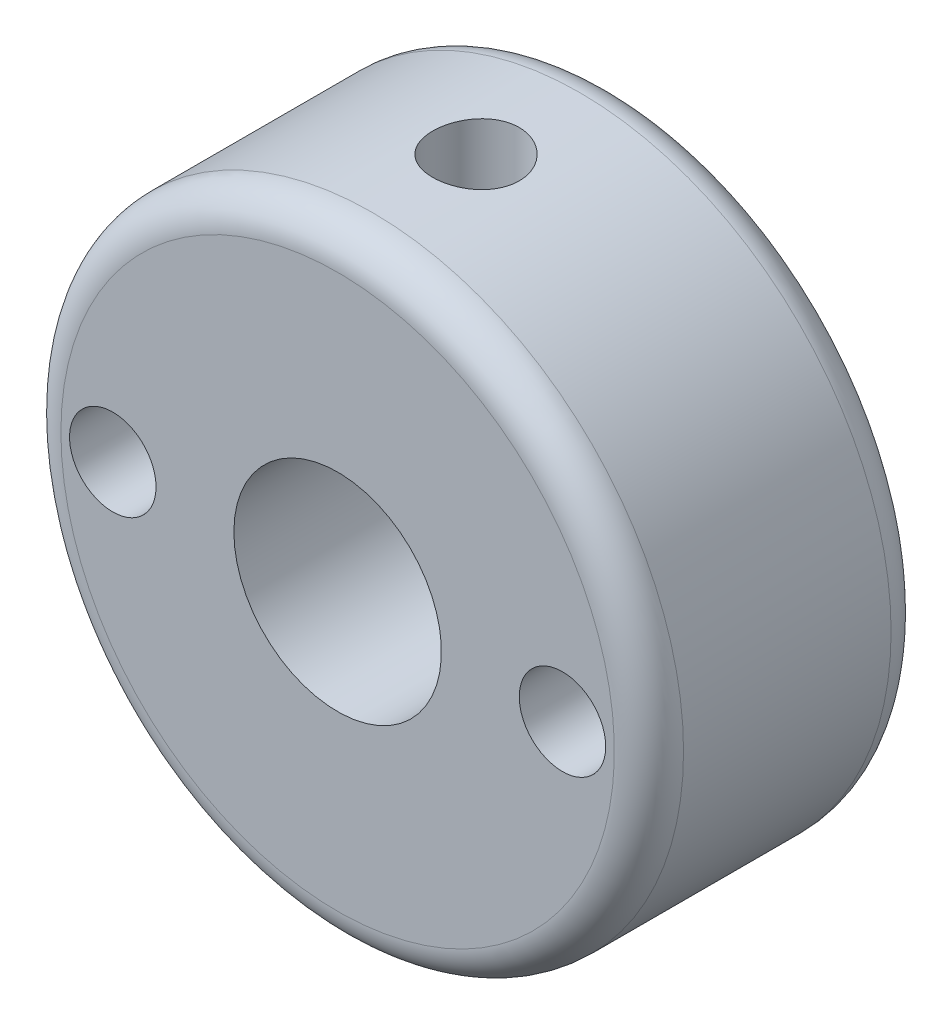
ISO-10303-21;
HEADER;
FILE_DESCRIPTION(('STEP AP214'),'2;1');
FILE_NAME('part.step','',(''),(''),'','','');
FILE_SCHEMA(('AUTOMOTIVE_DESIGN { 1 0 10303 214 1 1 1 1 }'));
ENDSEC;
DATA;
#1=APPLICATION_CONTEXT('core data for automotive mechanical design processes');
#2=APPLICATION_PROTOCOL_DEFINITION('international standard','automotive_design',2000,#1);
#3=PRODUCT_CONTEXT('',#1,'mechanical');
#4=PRODUCT('Part','Part','',(#3));
#5=PRODUCT_RELATED_PRODUCT_CATEGORY('part','',(#4));
#6=PRODUCT_DEFINITION_FORMATION('','',#4);
#7=PRODUCT_DEFINITION_CONTEXT('part definition',#1,'design');
#8=PRODUCT_DEFINITION('design','',#6,#7);
#9=PRODUCT_DEFINITION_SHAPE('','',#8);
#10=(LENGTH_UNIT() NAMED_UNIT(*) SI_UNIT(.MILLI.,.METRE.));
#11=(NAMED_UNIT(*) PLANE_ANGLE_UNIT() SI_UNIT($,.RADIAN.));
#12=(NAMED_UNIT(*) SI_UNIT($,.STERADIAN.) SOLID_ANGLE_UNIT());
#13=UNCERTAINTY_MEASURE_WITH_UNIT(LENGTH_MEASURE(1.E-05),#10,'distance_accuracy_value','');
#14=(GEOMETRIC_REPRESENTATION_CONTEXT(3) GLOBAL_UNCERTAINTY_ASSIGNED_CONTEXT((#13)) GLOBAL_UNIT_ASSIGNED_CONTEXT((#10,
#11,#12)) REPRESENTATION_CONTEXT('',''));
#15=CARTESIAN_POINT('',(0.,0.,0.));
#16=DIRECTION('',(0.,0.,1.));
#17=DIRECTION('',(1.,0.,0.));
#18=AXIS2_PLACEMENT_3D('',#15,#16,#17);
#19=CARTESIAN_POINT('',(0.,0.,8.));
#20=DIRECTION('',(0.,0.,-1.));
#21=DIRECTION('',(-1.,0.,0.));
#22=AXIS2_PLACEMENT_3D('',#19,#20,#21);
#23=PLANE('',#22);
#24=CARTESIAN_POINT('',(0.,0.,8.));
#25=DIRECTION('',(0.,0.,-1.));
#26=DIRECTION('',(-1.,0.,0.));
#27=AXIS2_PLACEMENT_3D('',#24,#25,#26);
#28=CIRCLE('',#27,8.);
#29=CARTESIAN_POINT('',(-8.,0.,8.));
#30=VERTEX_POINT('',#29);
#31=EDGE_CURVE('E10',#30,#30,#28,.F.);
#32=ORIENTED_EDGE('',*,*,#31,.T.);
#33=EDGE_LOOP('',(#32));
#34=FACE_BOUND('',#33,.T.);
#35=CARTESIAN_POINT('',(0.,0.,8.));
#36=DIRECTION('',(0.,0.,-1.));
#37=DIRECTION('',(-1.,0.,0.));
#38=AXIS2_PLACEMENT_3D('',#35,#36,#37);
#39=CIRCLE('',#38,3.);
#40=CARTESIAN_POINT('',(-3.,0.,8.));
#41=VERTEX_POINT('',#40);
#42=EDGE_CURVE('E109',#41,#41,#39,.T.);
#43=ORIENTED_EDGE('',*,*,#42,.T.);
#44=EDGE_LOOP('',(#43));
#45=FACE_BOUND('',#44,.T.);
#46=CARTESIAN_POINT('',(6.5,0.,8.));
#47=DIRECTION('',(0.,0.,1.));
#48=DIRECTION('',(1.,0.,0.));
#49=AXIS2_PLACEMENT_3D('',#46,#47,#48);
#50=CIRCLE('',#49,1.24999999999999);
#51=CARTESIAN_POINT('',(7.74999999999999,0.,8.));
#52=VERTEX_POINT('',#51);
#53=EDGE_CURVE('E112',#52,#52,#50,.T.);
#54=ORIENTED_EDGE('',*,*,#53,.F.);
#55=EDGE_LOOP('',(#54));
#56=FACE_BOUND('',#55,.T.);
#57=CARTESIAN_POINT('',(-6.5,0.,8.));
#58=DIRECTION('',(0.,0.,1.));
#59=DIRECTION('',(1.,0.,0.));
#60=AXIS2_PLACEMENT_3D('',#57,#58,#59);
#61=CIRCLE('',#60,1.24999999999999);
#62=CARTESIAN_POINT('',(-5.25000000000001,0.,8.));
#63=VERTEX_POINT('',#62);
#64=EDGE_CURVE('E117',#63,#63,#61,.T.);
#65=ORIENTED_EDGE('',*,*,#64,.F.);
#66=EDGE_LOOP('',(#65));
#67=FACE_BOUND('',#66,.T.);
#68=ADVANCED_FACE('F35',(#34,#45,#56,#67),#23,.F.);
#69=CARTESIAN_POINT('',(0.,0.,0.));
#70=DIRECTION('',(0.,0.,-1.));
#71=DIRECTION('',(-1.,0.,0.));
#72=AXIS2_PLACEMENT_3D('',#69,#70,#71);
#73=PLANE('',#72);
#74=CARTESIAN_POINT('',(0.,0.,0.));
#75=DIRECTION('',(0.,0.,-1.));
#76=DIRECTION('',(-1.,0.,0.));
#77=AXIS2_PLACEMENT_3D('',#74,#75,#76);
#78=CIRCLE('',#77,8.);
#79=CARTESIAN_POINT('',(-8.,0.,0.));
#80=VERTEX_POINT('',#79);
#81=EDGE_CURVE('E50',#80,#80,#78,.T.);
#82=ORIENTED_EDGE('',*,*,#81,.T.);
#83=EDGE_LOOP('',(#82));
#84=FACE_BOUND('',#83,.T.);
#85=CARTESIAN_POINT('',(0.,0.,0.));
#86=DIRECTION('',(0.,0.,-1.));
#87=DIRECTION('',(-1.,0.,0.));
#88=AXIS2_PLACEMENT_3D('',#85,#86,#87);
#89=CIRCLE('',#88,3.);
#90=CARTESIAN_POINT('',(-3.,0.,0.));
#91=VERTEX_POINT('',#90);
#92=EDGE_CURVE('E106',#91,#91,#89,.T.);
#93=ORIENTED_EDGE('',*,*,#92,.F.);
#94=EDGE_LOOP('',(#93));
#95=FACE_BOUND('',#94,.T.);
#96=CARTESIAN_POINT('',(6.5,0.,0.));
#97=DIRECTION('',(0.,0.,1.));
#98=DIRECTION('',(1.,0.,0.));
#99=AXIS2_PLACEMENT_3D('',#96,#97,#98);
#100=CIRCLE('',#99,1.25);
#101=CARTESIAN_POINT('',(7.75,0.,0.));
#102=VERTEX_POINT('',#101);
#103=EDGE_CURVE('E115',#102,#102,#100,.T.);
#104=ORIENTED_EDGE('',*,*,#103,.T.);
#105=EDGE_LOOP('',(#104));
#106=FACE_BOUND('',#105,.T.);
#107=CARTESIAN_POINT('',(-6.5,0.,0.));
#108=DIRECTION('',(0.,0.,1.));
#109=DIRECTION('',(1.,0.,0.));
#110=AXIS2_PLACEMENT_3D('',#107,#108,#109);
#111=CIRCLE('',#110,1.25);
#112=CARTESIAN_POINT('',(-5.25,0.,0.));
#113=VERTEX_POINT('',#112);
#114=EDGE_CURVE('E63',#113,#113,#111,.T.);
#115=ORIENTED_EDGE('',*,*,#114,.T.);
#116=EDGE_LOOP('',(#115));
#117=FACE_BOUND('',#116,.T.);
#118=ADVANCED_FACE('F83',(#84,#95,#106,#117),#73,.T.);
#119=CARTESIAN_POINT('',(0.,9.,4.));
#120=DIRECTION('',(0.,1.,0.));
#121=DIRECTION('',(0.,0.,1.));
#122=AXIS2_PLACEMENT_3D('',#119,#120,#121);
#123=CYLINDRICAL_SURFACE('',#122,1.25);
#124=CARTESIAN_POINT('',(0.,3.,5.25));
#125=CARTESIAN_POINT('',(0.0669580526362668,2.99999458367272,5.2499927949087));
#126=CARTESIAN_POINT('',(0.134021397063841,2.9977323297471,5.24458804147186));
#127=CARTESIAN_POINT('',(0.266247371156347,2.98890153579551,5.22316093507982));
#128=CARTESIAN_POINT('',(0.331404576423564,2.98232175901028,5.20711087553575));
#129=CARTESIAN_POINT('',(0.457688733653087,2.96556289038127,5.16508890821941));
#130=CARTESIAN_POINT('',(0.518828524426268,2.95539599975003,5.13915061053185));
#131=CARTESIAN_POINT('',(0.635829756679802,2.93245286470664,5.07822717676743));
#132=CARTESIAN_POINT('',(0.691692790015939,2.91967741092849,5.04324478102913));
#133=CARTESIAN_POINT('',(0.799448403559511,2.89207828351869,4.96337101740912));
#134=CARTESIAN_POINT('',(0.851041267517768,2.87718753326093,4.91809869121025));
#135=CARTESIAN_POINT('',(0.946159821091261,2.84732714068513,4.81973566521743));
#136=CARTESIAN_POINT('',(0.989681263153085,2.83235746106809,4.76664087510549));
#137=CARTESIAN_POINT('',(1.06953737697065,2.80321021812995,4.65097322243511));
#138=CARTESIAN_POINT('',(1.10541308153925,2.78910786873385,4.58806255157346));
#139=CARTESIAN_POINT('',(1.16593940588866,2.76435572357005,4.45642674207907));
#140=CARTESIAN_POINT('',(1.19059580836291,2.75370415000823,4.38770462051555));
#141=CARTESIAN_POINT('',(1.22674598312159,2.73778555387705,4.24984630823208));
#142=CARTESIAN_POINT('',(1.23881657877606,2.73228387651787,4.18088951660785));
#143=CARTESIAN_POINT('',(1.25125209967796,2.72661326219504,4.04172670731343));
#144=CARTESIAN_POINT('',(1.25162348054397,2.7264413842526,3.97152139997426));
#145=CARTESIAN_POINT('',(1.24108450363674,2.73125119560852,3.83759993956506));
#146=CARTESIAN_POINT('',(1.23103681112301,2.73583882723623,3.77379890343554));
#147=CARTESIAN_POINT('',(1.20139191015777,2.74898482773796,3.64888790899961));
#148=CARTESIAN_POINT('',(1.18179287287177,2.75754395703563,3.58777846850823));
#149=CARTESIAN_POINT('',(1.13321958727571,2.77786184772756,3.46844229700856));
#150=CARTESIAN_POINT('',(1.10405471539236,2.78968481949136,3.41030457908662));
#151=CARTESIAN_POINT('',(1.03731242580562,2.81518331141086,3.29952226611985));
#152=CARTESIAN_POINT('',(0.999731690519544,2.82885956129779,3.24687984938648));
#153=CARTESIAN_POINT('',(0.913495965543835,2.85792976877979,3.14390004126716));
#154=CARTESIAN_POINT('',(0.864173483207526,2.87337121404473,3.09413343261456));
#155=CARTESIAN_POINT('',(0.757729591051512,2.90325673112529,3.00338649704082));
#156=CARTESIAN_POINT('',(0.700606359448456,2.9177005687701,2.96240822830782));
#157=CARTESIAN_POINT('',(0.578447948693376,2.94438283556473,2.88956417638373));
#158=CARTESIAN_POINT('',(0.51326058244768,2.95656266543333,2.85793055484932));
#159=CARTESIAN_POINT('',(0.377852402526832,2.97689481414803,2.80627886039674));
#160=CARTESIAN_POINT('',(0.307634394795035,2.985049358458,2.78625436805618));
#161=CARTESIAN_POINT('',(0.168928113346228,2.99599641186385,2.75958400787336));
#162=CARTESIAN_POINT('',(0.100611285278639,2.99909541047125,2.75217214255625));
#163=CARTESIAN_POINT('',(-0.0363546554960886,3.00056050368745,2.74865377638591));
#164=CARTESIAN_POINT('',(-0.105003667152635,2.99892795711939,2.752544029748));
#165=CARTESIAN_POINT('',(-0.237098242341435,2.9913121765694,2.77097108480607));
#166=CARTESIAN_POINT('',(-0.300632966639386,2.98554887283989,2.7849699540972));
#167=CARTESIAN_POINT('',(-0.42438274897109,2.97048606772414,2.82246819454078));
#168=CARTESIAN_POINT('',(-0.48459738651836,2.96118611959704,2.8459687659503));
#169=CARTESIAN_POINT('',(-0.602108999869136,2.93958270645166,2.90257097571212));
#170=CARTESIAN_POINT('',(-0.659257236855324,2.92719491469281,2.93594818314603));
#171=CARTESIAN_POINT('',(-0.767346216231429,2.9007380457909,3.0110533777917));
#172=CARTESIAN_POINT('',(-0.81828435260194,2.88666826768733,3.05278485152928));
#173=CARTESIAN_POINT('',(-0.916333430274263,2.85712087895437,3.14690323327241));
#174=CARTESIAN_POINT('',(-0.962910697979835,2.84161451591029,3.19983850298626));
#175=CARTESIAN_POINT('',(-1.04666984610551,2.81184336768005,3.31302127593539));
#176=CARTESIAN_POINT('',(-1.08384959285617,2.79757886493438,3.37327043517173));
#177=CARTESIAN_POINT('',(-1.14815960208699,2.77181386243988,3.50061417530258));
#178=CARTESIAN_POINT('',(-1.17513918237329,2.76035562555111,3.56779403551483));
#179=CARTESIAN_POINT('',(-1.21717413951573,2.74208355658957,3.70637059381011));
#180=CARTESIAN_POINT('',(-1.23223934863687,2.73526589555752,3.77776376248335));
#181=CARTESIAN_POINT('',(-1.24904080348901,2.72763164537264,3.91681869919921));
#182=CARTESIAN_POINT('',(-1.25171380413129,2.72639350967162,3.98434466229262));
#183=CARTESIAN_POINT('',(-1.24615575523912,2.72893853011024,4.1188428611411));
#184=CARTESIAN_POINT('',(-1.23792637964721,2.73272091540306,4.18581518031369));
#185=CARTESIAN_POINT('',(-1.21158404780491,2.74449551302268,4.31409274746889));
#186=CARTESIAN_POINT('',(-1.19394903571466,2.7522835484648,4.37551667346339));
#187=CARTESIAN_POINT('',(-1.14976328202134,2.77103181199189,4.49454802135723));
#188=CARTESIAN_POINT('',(-1.12321003517252,2.78199293131693,4.55215436539878));
#189=CARTESIAN_POINT('',(-1.06010285935489,2.80666954560013,4.66569589594912));
#190=CARTESIAN_POINT('',(-1.02304360910483,2.82051102713679,4.72132233016829));
#191=CARTESIAN_POINT('',(-0.940684072630391,2.84903689053839,4.82586013936068));
#192=CARTESIAN_POINT('',(-0.895380928905618,2.86372156345875,4.87476917560057));
#193=CARTESIAN_POINT('',(-0.79390204577882,2.89356392850106,4.96814868168474));
#194=CARTESIAN_POINT('',(-0.737174739949026,2.90867817511791,5.01203643284065));
#195=CARTESIAN_POINT('',(-0.616600079253198,2.9366014362202,5.08969945354363));
#196=CARTESIAN_POINT('',(-0.552749497945745,2.9494093991674,5.12347011488955));
#197=CARTESIAN_POINT('',(-0.42073205671795,2.9710918336246,5.17920984543988));
#198=CARTESIAN_POINT('',(-0.352653990980635,2.98002782581964,5.2013647666173));
#199=CARTESIAN_POINT('',(-0.213410421846558,2.99321009768625,5.23370632907783));
#200=CARTESIAN_POINT('',(-0.142255316980957,2.99747105811967,5.24393044252988));
#201=CARTESIAN_POINT('',(-0.0472360819191829,2.99972287568934,5.24933316108645));
#202=CARTESIAN_POINT('',(-0.0236245946756569,3.00000191102536,5.25000254214922));
#203=CARTESIAN_POINT('',(0.,3.,5.25));
#204=B_SPLINE_CURVE_WITH_KNOTS('',3,(#124,#125,#126,#127,#128,#129,#130,#131,#132,#133,#134,
#135,#136,#137,#138,#139,#140,#141,#142,#143,#144,#145,#146,#147,#148,#149,#150,#151,#152,#153,
#154,#155,#156,#157,#158,#159,#160,#161,#162,#163,#164,#165,#166,#167,#168,#169,#170,#171,#172,
#173,#174,#175,#176,#177,#178,#179,#180,#181,#182,#183,#184,#185,#186,#187,#188,#189,#190,#191,
#192,#193,#194,#195,#196,#197,#198,#199,#200,#201,#202,#203),.UNSPECIFIED.,.T.,.F.,(4,2,2,2,2,2,
2,2,2,2,2,2,2,2,2,2,2,2,2,2,2,2,2,2,2,2,2,2,2,2,2,2,2,2,2,2,2,2,2,4),(0.,0.200806918883938,
0.402138540628696,0.602791851906301,0.803384436852974,1.01317936288807,1.22308438131465,
1.44331724539125,1.66343646730588,1.87295273137558,2.08235338249046,2.27570157202556,
2.46908679727212,2.66658713058714,2.86416545717206,3.07844141127896,3.29276749314588,
3.51204055060813,3.73119224218297,3.93648443393251,4.14171767493172,4.33676589735721,
4.53183876601785,4.73297135272161,4.93418805469496,5.14978488029294,5.36543061240341,
5.58414788359523,5.8026844707458,6.00439877559644,6.20608211297536,6.39837649964762,
6.59072494950612,6.79463893397441,6.99862373425944,7.21746535004889,7.43640649428582,
7.65172855819385,7.86637250469321,7.93722256499098),.UNSPECIFIED.);
#205=CARTESIAN_POINT('',(0.,3.,5.25));
#206=VERTEX_POINT('',#205);
#207=EDGE_CURVE('E100',#206,#206,#204,.T.);
#208=ORIENTED_EDGE('',*,*,#207,.F.);
#209=EDGE_LOOP('',(#208));
#210=FACE_BOUND('',#209,.T.);
#211=CARTESIAN_POINT('',(0.,9.,5.25));
#212=CARTESIAN_POINT('',(-0.0698524432674792,8.99999894112753,5.24999707641344));
#213=CARTESIAN_POINT('',(-0.139746876410525,8.99917821909749,5.24412500721024));
#214=CARTESIAN_POINT('',(-0.277586159937056,8.99598316286198,5.22079550905035));
#215=CARTESIAN_POINT('',(-0.345528975998051,8.99360726484072,5.20332641839353));
#216=CARTESIAN_POINT('',(-0.477449936054394,8.98756916249447,5.15733148038858));
#217=CARTESIAN_POINT('',(-0.541430886330462,8.98390788118544,5.12881356553055));
#218=CARTESIAN_POINT('',(-0.663688186066638,8.97570481006727,5.06154896636124));
#219=CARTESIAN_POINT('',(-0.721965412327888,8.97116315591379,5.0228038576146));
#220=CARTESIAN_POINT('',(-0.831564576835309,8.96167110812553,4.93590611207195));
#221=CARTESIAN_POINT('',(-0.882842518790516,8.95671841784774,4.88769823037006));
#222=CARTESIAN_POINT('',(-0.976608234008467,8.94698072235377,4.78336218085061));
#223=CARTESIAN_POINT('',(-1.01909552946635,8.94219572626413,4.72723358279095));
#224=CARTESIAN_POINT('',(-1.09424186139764,8.93331280195876,4.60835810446567));
#225=CARTESIAN_POINT('',(-1.12685893577153,8.92921783911826,4.5455844573968));
#226=CARTESIAN_POINT('',(-1.18107087638653,8.9222095544648,4.41538379504843));
#227=CARTESIAN_POINT('',(-1.20266625739018,8.91929617746777,4.34795699725896));
#228=CARTESIAN_POINT('',(-1.23408646989725,8.91500325152303,4.21082413412879));
#229=CARTESIAN_POINT('',(-1.24398617833559,8.91361394942638,4.14113553555097));
#230=CARTESIAN_POINT('',(-1.25196586814038,8.91249677033615,4.00107340136254));
#231=CARTESIAN_POINT('',(-1.25004643292129,8.91276881133565,3.93069989973122));
#232=CARTESIAN_POINT('',(-1.23450363802969,8.91493465758728,3.79179120897347));
#233=CARTESIAN_POINT('',(-1.22096324330855,8.91681696642587,3.72324653180948));
#234=CARTESIAN_POINT('',(-1.18269256535991,8.92197331658115,3.58941166568421));
#235=CARTESIAN_POINT('',(-1.15796200719353,8.92524739209301,3.52412155673045));
#236=CARTESIAN_POINT('',(-1.09792538280573,8.93283122971518,3.39839427134722));
#237=CARTESIAN_POINT('',(-1.06258375105995,8.93714446505612,3.33797429604758));
#238=CARTESIAN_POINT('',(-0.982353578958053,8.94631804418278,3.22389103836506));
#239=CARTESIAN_POINT('',(-0.937464500359812,8.95117841880646,3.17022813718728));
#240=CARTESIAN_POINT('',(-0.838956215124468,8.96094958209835,3.07070114459299));
#241=CARTESIAN_POINT('',(-0.78526559218933,8.96586044627415,3.02490771633149));
#242=CARTESIAN_POINT('',(-0.670922859167277,8.97514050674014,2.94297142256395));
#243=CARTESIAN_POINT('',(-0.610270725934996,8.97950970122931,2.90682858914517));
#244=CARTESIAN_POINT('',(-0.483668566732571,8.98721779212188,2.84521749124961));
#245=CARTESIAN_POINT('',(-0.417716089958331,8.99055620841331,2.81975419907646));
#246=CARTESIAN_POINT('',(-0.282414617975588,8.99582244302653,2.78028392791702));
#247=CARTESIAN_POINT('',(-0.213065819610992,8.99775034299601,2.76627628581537));
#248=CARTESIAN_POINT('',(-0.0735506507379422,8.99996760516492,2.75020779285972));
#249=CARTESIAN_POINT('',(-0.00339568328223031,9.00027030327137,2.74804970487464));
#250=CARTESIAN_POINT('',(0.136275022553969,8.99923922007978,2.75548417654772));
#251=CARTESIAN_POINT('',(0.205790777778711,8.99790548202965,2.76507642566666));
#252=CARTESIAN_POINT('',(0.341918779308759,8.99375965195284,2.79565845560324));
#253=CARTESIAN_POINT('',(0.408541763946675,8.99095364519698,2.81660133297071));
#254=CARTESIAN_POINT('',(0.537330456139086,8.98417711217329,2.86924099234226));
#255=CARTESIAN_POINT('',(0.599495980656536,8.98020653811879,2.90093821564694));
#256=CARTESIAN_POINT('',(0.718035810499775,8.97150954082181,2.97441824451338));
#257=CARTESIAN_POINT('',(0.774371184438056,8.96677851553782,3.016263300766));
#258=CARTESIAN_POINT('',(0.87925417276898,8.95710284930006,3.10876385195142));
#259=CARTESIAN_POINT('',(0.927801401893307,8.95215819779385,3.1594197824873));
#260=CARTESIAN_POINT('',(1.01607974304115,8.94257081023239,3.26853494672837));
#261=CARTESIAN_POINT('',(1.05574600476847,8.93793045954482,3.32704688764327));
#262=CARTESIAN_POINT('',(1.12468695508689,8.92951793446703,3.44996001851086));
#263=CARTESIAN_POINT('',(1.15396189183904,8.92574573934466,3.51436106777625));
#264=CARTESIAN_POINT('',(1.20118657145913,8.91951345452543,3.64702354578474));
#265=CARTESIAN_POINT('',(1.21917157417326,8.91704928346968,3.71527222279974));
#266=CARTESIAN_POINT('',(1.24341873550689,8.91370081228886,3.85385776577743));
#267=CARTESIAN_POINT('',(1.24968157911894,8.91281641984846,3.92419450947847));
#268=CARTESIAN_POINT('',(1.25029208082018,8.91273074448822,4.06431381146004));
#269=CARTESIAN_POINT('',(1.24474165841307,8.91351506465158,4.13409593850588));
#270=CARTESIAN_POINT('',(1.22210038835406,8.91664731052215,4.27172460841475));
#271=CARTESIAN_POINT('',(1.20500954927505,8.91899523506783,4.3395711527156));
#272=CARTESIAN_POINT('',(1.1598067233738,8.92498537468198,4.47138137218678));
#273=CARTESIAN_POINT('',(1.13170083734509,8.92862687318732,4.5353471741365));
#274=CARTESIAN_POINT('',(1.06527577701553,8.93679486162302,4.6576715834595));
#275=CARTESIAN_POINT('',(1.02695635742405,8.94132137280736,4.71603005612003));
#276=CARTESIAN_POINT('',(0.940817900572817,8.95079601194598,4.82600262825919));
#277=CARTESIAN_POINT('',(0.892923123926585,8.9557473092005,4.87755713579389));
#278=CARTESIAN_POINT('',(0.789153098909224,8.9654864535163,4.97193457291452));
#279=CARTESIAN_POINT('',(0.73327598706804,8.97027426208699,5.01475545796018));
#280=CARTESIAN_POINT('',(0.614821941865001,8.97917230387635,5.09062624054552));
#281=CARTESIAN_POINT('',(0.552214803422001,8.98327925254998,5.12362935049968));
#282=CARTESIAN_POINT('',(0.422321399113687,8.99032025416553,5.17860417514526));
#283=CARTESIAN_POINT('',(0.355040177626121,8.99325554918744,5.20058757828223));
#284=CARTESIAN_POINT('',(0.239529012760907,8.99693485713489,5.22778270119299));
#285=CARTESIAN_POINT('',(0.192019668179785,8.99807852526027,5.23610181399691));
#286=CARTESIAN_POINT('',(0.0963468711203363,8.9996114581541,5.24721144433625));
#287=CARTESIAN_POINT('',(0.0481834251286112,9.00000073039825,5.25000201665693));
#288=CARTESIAN_POINT('',(0.,9.,5.25));
#289=B_SPLINE_CURVE_WITH_KNOTS('',3,(#211,#212,#213,#214,#215,#216,#217,#218,#219,#220,#221,
#222,#223,#224,#225,#226,#227,#228,#229,#230,#231,#232,#233,#234,#235,#236,#237,#238,#239,#240,
#241,#242,#243,#244,#245,#246,#247,#248,#249,#250,#251,#252,#253,#254,#255,#256,#257,#258,#259,
#260,#261,#262,#263,#264,#265,#266,#267,#268,#269,#270,#271,#272,#273,#274,#275,#276,#277,#278,
#279,#280,#281,#282,#283,#284,#285,#286,#287,#288),.UNSPECIFIED.,.T.,.F.,(4,2,2,2,2,2,2,2,2,2,2,
2,2,2,2,2,2,2,2,2,2,2,2,2,2,2,2,2,2,2,2,2,2,2,2,2,2,2,4),(0.,0.209381295059175,
0.418973458745447,0.628415424004144,0.837825142200537,1.0484958752077,1.25917805595891,
1.47074373528116,1.68229953263233,1.89249345858176,2.10267700905926,2.31137237127791,
2.52007286135607,2.72948082119297,2.93890058963983,3.15011234914944,3.36132481090822,
3.57263550251898,3.78393396145113,3.99349589004416,4.20305228043052,4.4117492645698,
4.62045481354832,4.83047455215843,5.04050467694122,5.2520217860405,5.46353384344124,
5.67438199262966,5.88521782037458,6.09424202940505,6.30326608316045,6.512174530099,
6.72108799468395,6.93172442182196,7.1424101024746,7.35408430824959,7.56553351660858,
7.70996379646389,7.8543926450753),.UNSPECIFIED.);
#290=CARTESIAN_POINT('',(0.,9.,5.25));
#291=VERTEX_POINT('',#290);
#292=EDGE_CURVE('E55',#291,#291,#289,.T.);
#293=ORIENTED_EDGE('',*,*,#292,.F.);
#294=EDGE_LOOP('',(#293));
#295=FACE_BOUND('',#294,.T.);
#296=ADVANCED_FACE('F65',(#210,#295),#123,.F.);
#297=CARTESIAN_POINT('',(-6.5,0.,8.));
#298=DIRECTION('',(0.,0.,1.));
#299=DIRECTION('',(1.,0.,0.));
#300=AXIS2_PLACEMENT_3D('',#297,#298,#299);
#301=CYLINDRICAL_SURFACE('',#300,1.24999999999999);
#302=ORIENTED_EDGE('',*,*,#114,.F.);
#303=EDGE_LOOP('',(#302));
#304=FACE_BOUND('',#303,.T.);
#305=ORIENTED_EDGE('',*,*,#64,.T.);
#306=EDGE_LOOP('',(#305));
#307=FACE_BOUND('',#306,.T.);
#308=ADVANCED_FACE('F92',(#304,#307),#301,.F.);
#309=CARTESIAN_POINT('',(6.5,0.,8.));
#310=DIRECTION('',(0.,0.,1.));
#311=DIRECTION('',(1.,0.,0.));
#312=AXIS2_PLACEMENT_3D('',#309,#310,#311);
#313=CYLINDRICAL_SURFACE('',#312,1.24999999999999);
#314=ORIENTED_EDGE('',*,*,#103,.F.);
#315=EDGE_LOOP('',(#314));
#316=FACE_BOUND('',#315,.T.);
#317=ORIENTED_EDGE('',*,*,#53,.T.);
#318=EDGE_LOOP('',(#317));
#319=FACE_BOUND('',#318,.T.);
#320=ADVANCED_FACE('F78',(#316,#319),#313,.F.);
#321=CARTESIAN_POINT('',(0.,0.,0.));
#322=DIRECTION('',(0.,0.,-1.));
#323=DIRECTION('',(-1.,0.,0.));
#324=AXIS2_PLACEMENT_3D('',#321,#322,#323);
#325=CYLINDRICAL_SURFACE('',#324,3.);
#326=ORIENTED_EDGE('',*,*,#207,.T.);
#327=EDGE_LOOP('',(#326));
#328=FACE_BOUND('',#327,.T.);
#329=ORIENTED_EDGE('',*,*,#42,.F.);
#330=EDGE_LOOP('',(#329));
#331=FACE_BOUND('',#330,.T.);
#332=ORIENTED_EDGE('',*,*,#92,.T.);
#333=EDGE_LOOP('',(#332));
#334=FACE_BOUND('',#333,.T.);
#335=ADVANCED_FACE('F72',(#328,#331,#334),#325,.F.);
#336=CARTESIAN_POINT('',(0.,0.,-2.));
#337=DIRECTION('',(0.,0.,1.));
#338=DIRECTION('',(1.,0.,0.));
#339=AXIS2_PLACEMENT_3D('',#336,#337,#338);
#340=CYLINDRICAL_SURFACE('',#339,9.);
#341=CARTESIAN_POINT('',(0.,0.,1.));
#342=DIRECTION('',(0.,0.,-1.));
#343=DIRECTION('',(-1.,0.,0.));
#344=AXIS2_PLACEMENT_3D('',#341,#342,#343);
#345=CIRCLE('',#344,9.);
#346=CARTESIAN_POINT('',(-9.,0.,1.));
#347=VERTEX_POINT('',#346);
#348=EDGE_CURVE('E42',#347,#347,#345,.F.);
#349=ORIENTED_EDGE('',*,*,#348,.T.);
#350=EDGE_LOOP('',(#349));
#351=FACE_BOUND('',#350,.T.);
#352=CARTESIAN_POINT('',(0.,0.,7.));
#353=DIRECTION('',(0.,0.,-1.));
#354=DIRECTION('',(-1.,0.,0.));
#355=AXIS2_PLACEMENT_3D('',#352,#353,#354);
#356=CIRCLE('',#355,9.);
#357=CARTESIAN_POINT('',(-9.,0.,7.));
#358=VERTEX_POINT('',#357);
#359=EDGE_CURVE('E46',#358,#358,#356,.T.);
#360=ORIENTED_EDGE('',*,*,#359,.T.);
#361=EDGE_LOOP('',(#360));
#362=FACE_BOUND('',#361,.T.);
#363=ORIENTED_EDGE('',*,*,#292,.T.);
#364=EDGE_LOOP('',(#363));
#365=FACE_BOUND('',#364,.T.);
#366=ADVANCED_FACE('F68',(#351,#362,#365),#340,.T.);
#367=CARTESIAN_POINT('',(0.,0.,1.));
#368=DIRECTION('',(0.,0.,-1.));
#369=DIRECTION('',(-1.,0.,0.));
#370=AXIS2_PLACEMENT_3D('',#367,#368,#369);
#371=TOROIDAL_SURFACE('',#370,8.,1.);
#372=ORIENTED_EDGE('',*,*,#348,.F.);
#373=EDGE_LOOP('',(#372));
#374=FACE_BOUND('',#373,.T.);
#375=ORIENTED_EDGE('',*,*,#81,.F.);
#376=EDGE_LOOP('',(#375));
#377=FACE_BOUND('',#376,.T.);
#378=ADVANCED_FACE('F71',(#374,#377),#371,.T.);
#379=CARTESIAN_POINT('',(0.,0.,7.));
#380=DIRECTION('',(0.,0.,-1.));
#381=DIRECTION('',(-1.,0.,0.));
#382=AXIS2_PLACEMENT_3D('',#379,#380,#381);
#383=TOROIDAL_SURFACE('',#382,8.,1.);
#384=ORIENTED_EDGE('',*,*,#359,.F.);
#385=EDGE_LOOP('',(#384));
#386=FACE_BOUND('',#385,.T.);
#387=ORIENTED_EDGE('',*,*,#31,.F.);
#388=EDGE_LOOP('',(#387));
#389=FACE_BOUND('',#388,.T.);
#390=ADVANCED_FACE('F37',(#386,#389),#383,.T.);
#391=CLOSED_SHELL('',(#68,#118,#296,#308,#320,#335,#366,#378,#390));
#392=MANIFOLD_SOLID_BREP('B2',#391);
#393=ADVANCED_BREP_SHAPE_REPRESENTATION('',(#18,#392),#14);
#394=SHAPE_DEFINITION_REPRESENTATION(#9,#393);
ENDSEC;
END-ISO-10303-21;
